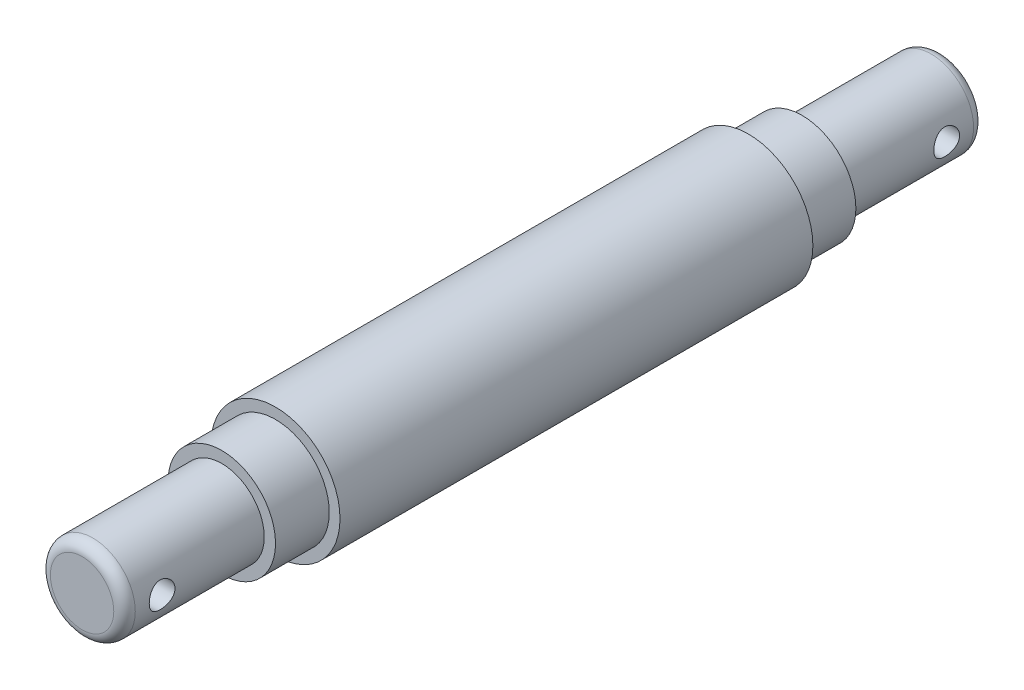
ISO-10303-21;
HEADER;
FILE_DESCRIPTION(('STEP AP214'),'2;1');
FILE_NAME('part.step','',(''),(''),'','','');
FILE_SCHEMA(('AUTOMOTIVE_DESIGN { 1 0 10303 214 1 1 1 1 }'));
ENDSEC;
DATA;
#1=APPLICATION_CONTEXT('core data for automotive mechanical design processes');
#2=APPLICATION_PROTOCOL_DEFINITION('international standard','automotive_design',2000,#1);
#3=PRODUCT_CONTEXT('',#1,'mechanical');
#4=PRODUCT('Part','Part','',(#3));
#5=PRODUCT_RELATED_PRODUCT_CATEGORY('part','',(#4));
#6=PRODUCT_DEFINITION_FORMATION('','',#4);
#7=PRODUCT_DEFINITION_CONTEXT('part definition',#1,'design');
#8=PRODUCT_DEFINITION('design','',#6,#7);
#9=PRODUCT_DEFINITION_SHAPE('','',#8);
#10=(LENGTH_UNIT() NAMED_UNIT(*) SI_UNIT(.MILLI.,.METRE.));
#11=(NAMED_UNIT(*) PLANE_ANGLE_UNIT() SI_UNIT($,.RADIAN.));
#12=(NAMED_UNIT(*) SI_UNIT($,.STERADIAN.) SOLID_ANGLE_UNIT());
#13=UNCERTAINTY_MEASURE_WITH_UNIT(LENGTH_MEASURE(1.E-05),#10,'distance_accuracy_value','');
#14=(GEOMETRIC_REPRESENTATION_CONTEXT(3) GLOBAL_UNCERTAINTY_ASSIGNED_CONTEXT((#13)) GLOBAL_UNIT_ASSIGNED_CONTEXT((#10,
#11,#12)) REPRESENTATION_CONTEXT('',''));
#15=CARTESIAN_POINT('',(0.,0.,0.));
#16=DIRECTION('',(0.,0.,1.));
#17=DIRECTION('',(1.,0.,0.));
#18=AXIS2_PLACEMENT_3D('',#15,#16,#17);
#19=CARTESIAN_POINT('',(0.,0.,13.));
#20=DIRECTION('',(0.,0.,-1.));
#21=DIRECTION('',(-1.,0.,0.));
#22=AXIS2_PLACEMENT_3D('',#19,#20,#21);
#23=CYLINDRICAL_SURFACE('',#22,3.95);
#24=CARTESIAN_POINT('',(-3.95,0.,4.7));
#25=CARTESIAN_POINT('',(-3.94999950148961,-0.0657921053393092,4.69999930906702));
#26=CARTESIAN_POINT('',(-3.94834057311497,-0.131591214838203,4.6945713423082));
#27=CARTESIAN_POINT('',(-3.94188498697175,-0.261270865350392,4.6730560327882));
#28=CARTESIAN_POINT('',(-3.93708746139314,-0.325150870627959,4.6569657419196));
#29=CARTESIAN_POINT('',(-3.92487988296748,-0.449103270402122,4.61471437021637));
#30=CARTESIAN_POINT('',(-3.91747374305666,-0.509181209664436,4.58856836763629));
#31=CARTESIAN_POINT('',(-3.90081718663398,-0.624100282433898,4.52701029085556));
#32=CARTESIAN_POINT('',(-3.89156651099519,-0.678940678549645,4.4915969145227));
#33=CARTESIAN_POINT('',(-3.87190239177238,-0.783438437222785,4.41141392945013));
#34=CARTESIAN_POINT('',(-3.86146466337097,-0.832920325244443,4.36642160808127));
#35=CARTESIAN_POINT('',(-3.84074643294284,-0.923765255505192,4.26883243051873));
#36=CARTESIAN_POINT('',(-3.83046595848297,-0.965126888957125,4.21623425752584));
#37=CARTESIAN_POINT('',(-3.81096820781044,-1.03948900030353,4.10343139989179));
#38=CARTESIAN_POINT('',(-3.80178104820255,-1.07227379069014,4.0430788331166));
#39=CARTESIAN_POINT('',(-3.78587377700205,-1.12715664878844,3.91739279236636));
#40=CARTESIAN_POINT('',(-3.77915305597243,-1.14925735687914,3.85206055365288));
#41=CARTESIAN_POINT('',(-3.76919296296908,-1.18150913793118,3.72024308420593));
#42=CARTESIAN_POINT('',(-3.76585939822971,-1.19198431895655,3.6538444632701));
#43=CARTESIAN_POINT('',(-3.76277100880303,-1.20169991107967,3.5201549851538));
#44=CARTESIAN_POINT('',(-3.76301529202458,-1.20094312272632,3.45286435456517));
#45=CARTESIAN_POINT('',(-3.76697161773738,-1.1884705081571,3.32195015706232));
#46=CARTESIAN_POINT('',(-3.7705546058486,-1.17716250700933,3.25828318605416));
#47=CARTESIAN_POINT('',(-3.78057558453502,-1.14456806673587,3.13379647114953));
#48=CARTESIAN_POINT('',(-3.7870138633498,-1.12328062017983,3.0729770153932));
#49=CARTESIAN_POINT('',(-3.80212175360936,-1.07103490290146,2.95492205528855));
#50=CARTESIAN_POINT('',(-3.81082129239325,-1.03994563160967,2.89774851954395));
#51=CARTESIAN_POINT('',(-3.82945730084039,-0.969069803090083,2.78929413758052));
#52=CARTESIAN_POINT('',(-3.8393940765405,-0.929281092164125,2.73801475536715));
#53=CARTESIAN_POINT('',(-3.85990662941459,-0.840117660833641,2.64049344535494));
#54=CARTESIAN_POINT('',(-3.87049153542939,-0.790405027053219,2.59456184826499));
#55=CARTESIAN_POINT('',(-3.8907306221033,-0.683850928056176,2.5116141422669));
#56=CARTESIAN_POINT('',(-3.90038474113935,-0.62700899141406,2.474598623408));
#57=CARTESIAN_POINT('',(-3.91776652995739,-0.507235607809572,2.4103388738867));
#58=CARTESIAN_POINT('',(-3.92548020503653,-0.44426422581595,2.38316503820175));
#59=CARTESIAN_POINT('',(-3.93801108754001,-0.314356032727517,2.33988627876673));
#60=CARTESIAN_POINT('',(-3.94282912421219,-0.247420362956477,2.32377818583952));
#61=CARTESIAN_POINT('',(-3.94889402423303,-0.114120636053968,2.30360840283639));
#62=CARTESIAN_POINT('',(-3.95026547137128,-0.0478257706931135,2.29912626814582));
#63=CARTESIAN_POINT('',(-3.94964905795108,0.0845739664892634,2.30115508783461));
#64=CARTESIAN_POINT('',(-3.94766165842204,0.150678863138068,2.30766453352876));
#65=CARTESIAN_POINT('',(-3.94063250926793,0.279224843718511,2.33115248464411));
#66=CARTESIAN_POINT('',(-3.93566287748284,0.341715383064578,2.34788396335906));
#67=CARTESIAN_POINT('',(-3.9232462867588,0.462987512144223,2.39104256352873));
#68=CARTESIAN_POINT('',(-3.91579902739437,0.521768651064517,2.41747086081413));
#69=CARTESIAN_POINT('',(-3.89897895098375,0.635489778460967,2.47996993053552));
#70=CARTESIAN_POINT('',(-3.88956496603778,0.690306912058738,2.51625286629778));
#71=CARTESIAN_POINT('',(-3.86989097410411,0.793217107200196,2.59717445146228));
#72=CARTESIAN_POINT('',(-3.85963075016098,0.841308435836414,2.64181524736854));
#73=CARTESIAN_POINT('',(-3.8389403158374,0.931262194728938,2.74016150577723));
#74=CARTESIAN_POINT('',(-3.82851804368209,0.972825315903955,2.79414300837538));
#75=CARTESIAN_POINT('',(-3.8090881755083,1.04632580306949,2.90854100899331));
#76=CARTESIAN_POINT('',(-3.80008054641565,1.07826339411975,2.96895735651179));
#77=CARTESIAN_POINT('',(-3.78460257028509,1.1313931380966,3.09433664984492));
#78=CARTESIAN_POINT('',(-3.77812098085675,1.15263302867236,3.15927789797527));
#79=CARTESIAN_POINT('',(-3.76847037643667,1.18380847718295,3.29204998471573));
#80=CARTESIAN_POINT('',(-3.76530018925136,1.19374803539959,3.35987979195805));
#81=CARTESIAN_POINT('',(-3.76274882724403,1.20176405179564,3.49338836687881));
#82=CARTESIAN_POINT('',(-3.76321151382289,1.20032934218194,3.55903517801601));
#83=CARTESIAN_POINT('',(-3.76749719259433,1.18680835860971,3.68910509986034));
#84=CARTESIAN_POINT('',(-3.77132004375065,1.17472253171075,3.7535282618118));
#85=CARTESIAN_POINT('',(-3.78178924861813,1.14056150948796,3.8785005993841));
#86=CARTESIAN_POINT('',(-3.7883980639779,1.11861887679372,3.93908938954065));
#87=CARTESIAN_POINT('',(-3.80368682812306,1.06547063438702,4.05577392163372));
#88=CARTESIAN_POINT('',(-3.81236718094976,1.03426321734227,4.1118687842014));
#89=CARTESIAN_POINT('',(-3.83122441855044,0.962110752635532,4.22023355022249));
#90=CARTESIAN_POINT('',(-3.84144499898209,0.920846329538669,4.27228319179532));
#91=CARTESIAN_POINT('',(-3.86202232713825,0.830322181374977,4.36887763125794));
#92=CARTESIAN_POINT('',(-3.872379109857,0.781060363153478,4.41342045815514));
#93=CARTESIAN_POINT('',(-3.89243751616363,0.674145848788933,4.49508126382335));
#94=CARTESIAN_POINT('',(-3.90210985106116,0.61628443568486,4.53193393655291));
#95=CARTESIAN_POINT('',(-3.91935319911683,0.494893212202997,4.59533761137733));
#96=CARTESIAN_POINT('',(-3.92692514826385,0.431365943417147,4.62189320423625));
#97=CARTESIAN_POINT('',(-3.93849330935894,0.307034616834357,4.66170303728427));
#98=CARTESIAN_POINT('',(-3.94277212268364,0.246597141950737,4.67602475329009));
#99=CARTESIAN_POINT('',(-3.94852545465588,0.124108329921255,4.69517271922448));
#100=CARTESIAN_POINT('',(-3.95000047021142,0.0620572807202984,4.70000065171074));
#101=CARTESIAN_POINT('',(-3.95,0.,4.7));
#102=B_SPLINE_CURVE_WITH_KNOTS('',3,(#24,#25,#26,#27,#28,#29,#30,#31,#32,#33,#34,#35,#36,#37,
#38,#39,#40,#41,#42,#43,#44,#45,#46,#47,#48,#49,#50,#51,#52,#53,#54,#55,#56,#57,#58,#59,#60,#61,
#62,#63,#64,#65,#66,#67,#68,#69,#70,#71,#72,#73,#74,#75,#76,#77,#78,#79,#80,#81,#82,#83,#84,#85,
#86,#87,#88,#89,#90,#91,#92,#93,#94,#95,#96,#97,#98,#99,#100,#101),.UNSPECIFIED.,.T.,.F.,(4,2,2,
2,2,2,2,2,2,2,2,2,2,2,2,2,2,2,2,2,2,2,2,2,2,2,2,2,2,2,2,2,2,2,2,2,2,2,4),(0.,0.197148320035392,
0.394351173873382,0.591259473294278,0.78819545460649,0.99034080236687,1.19252118949645,
1.39938126808359,1.60619019875128,1.80707614853398,2.00791201079834,2.20129315930618,
2.39469383394963,2.59079745889567,2.78694968780096,2.99151370492322,3.19609125598954,
3.40210447220442,3.6080586625695,3.80645362401527,4.00482135632748,4.19857515486445,
4.39235245564505,4.59068721838334,4.78907298841319,4.99485980438989,5.20064180838009,
5.40549720473313,5.61028006032374,5.80631124083041,6.00233419370823,6.19579632450157,
6.38929621983988,6.59000270555273,6.79076180702599,6.99759277849253,7.20433143185222,
7.39032118612837,7.57627797496914),.UNSPECIFIED.);
#103=CARTESIAN_POINT('',(-3.95,0.,4.7));
#104=VERTEX_POINT('',#103);
#105=EDGE_CURVE('E35',#104,#104,#102,.T.);
#106=ORIENTED_EDGE('',*,*,#105,.T.);
#107=EDGE_LOOP('',(#106));
#108=FACE_BOUND('',#107,.T.);
#109=CARTESIAN_POINT('',(3.95,0.,2.3));
#110=CARTESIAN_POINT('',(3.94999950148961,-0.0657921053393094,2.30000069093297));
#111=CARTESIAN_POINT('',(3.94834057311497,-0.131591214838203,2.3054286576918));
#112=CARTESIAN_POINT('',(3.94188498697175,-0.261270865350393,2.32694396721179));
#113=CARTESIAN_POINT('',(3.93708746139314,-0.325150870627959,2.34303425808039));
#114=CARTESIAN_POINT('',(3.92487988296748,-0.449103270402122,2.38528562978362));
#115=CARTESIAN_POINT('',(3.91747374305666,-0.509181209664436,2.4114316323637));
#116=CARTESIAN_POINT('',(3.90081718663398,-0.624100282433898,2.47298970914444));
#117=CARTESIAN_POINT('',(3.89156651099519,-0.678940678549646,2.5084030854773));
#118=CARTESIAN_POINT('',(3.87190239177238,-0.783438437222785,2.58858607054987));
#119=CARTESIAN_POINT('',(3.86146466337097,-0.832920325244444,2.63357839191873));
#120=CARTESIAN_POINT('',(3.84074643294284,-0.923765255505193,2.73116756948126));
#121=CARTESIAN_POINT('',(3.83046595848297,-0.965126888957126,2.78376574247416));
#122=CARTESIAN_POINT('',(3.81096820781044,-1.03948900030353,2.89656860010821));
#123=CARTESIAN_POINT('',(3.80178104820255,-1.07227379069014,2.9569211668834));
#124=CARTESIAN_POINT('',(3.78587377700205,-1.12715664878844,3.08260720763363));
#125=CARTESIAN_POINT('',(3.77915305597243,-1.14925735687915,3.14793944634711));
#126=CARTESIAN_POINT('',(3.76919296296908,-1.18150913793118,3.27975691579407));
#127=CARTESIAN_POINT('',(3.76585939822971,-1.19198431895655,3.3461555367299));
#128=CARTESIAN_POINT('',(3.76277100880303,-1.20169991107967,3.4798450148462));
#129=CARTESIAN_POINT('',(3.76301529202458,-1.20094312272632,3.54713564543482));
#130=CARTESIAN_POINT('',(3.76697161773738,-1.1884705081571,3.67804984293767));
#131=CARTESIAN_POINT('',(3.7705546058486,-1.17716250700933,3.74171681394584));
#132=CARTESIAN_POINT('',(3.78057558453502,-1.14456806673587,3.86620352885046));
#133=CARTESIAN_POINT('',(3.7870138633498,-1.12328062017983,3.92702298460679));
#134=CARTESIAN_POINT('',(3.80212175360936,-1.07103490290146,4.04507794471145));
#135=CARTESIAN_POINT('',(3.81082129239325,-1.03994563160967,4.10225148045604));
#136=CARTESIAN_POINT('',(3.82945730084039,-0.969069803090083,4.21070586241947));
#137=CARTESIAN_POINT('',(3.8393940765405,-0.929281092164126,4.26198524463285));
#138=CARTESIAN_POINT('',(3.85990662941459,-0.840117660833642,4.35950655464505));
#139=CARTESIAN_POINT('',(3.87049153542939,-0.79040502705322,4.405438151735));
#140=CARTESIAN_POINT('',(3.8907306221033,-0.683850928056177,4.4883858577331));
#141=CARTESIAN_POINT('',(3.90038474113935,-0.627008991414061,4.52540137659199));
#142=CARTESIAN_POINT('',(3.91776652995739,-0.507235607809573,4.58966112611329));
#143=CARTESIAN_POINT('',(3.92548020503653,-0.444264225815951,4.61683496179825));
#144=CARTESIAN_POINT('',(3.93801108754001,-0.314356032727518,4.66011372123327));
#145=CARTESIAN_POINT('',(3.94282912421219,-0.247420362956478,4.67622181416047));
#146=CARTESIAN_POINT('',(3.94889402423303,-0.114120636053968,4.69639159716361));
#147=CARTESIAN_POINT('',(3.95026547137128,-0.0478257706931138,4.70087373185417));
#148=CARTESIAN_POINT('',(3.94964905795108,0.0845739664892633,4.69884491216539));
#149=CARTESIAN_POINT('',(3.94766165842204,0.150678863138068,4.69233546647123));
#150=CARTESIAN_POINT('',(3.94063250926793,0.27922484371851,4.66884751535588));
#151=CARTESIAN_POINT('',(3.93566287748284,0.341715383064577,4.65211603664094));
#152=CARTESIAN_POINT('',(3.9232462867588,0.462987512144222,4.60895743647126));
#153=CARTESIAN_POINT('',(3.91579902739437,0.521768651064517,4.58252913918586));
#154=CARTESIAN_POINT('',(3.89897895098375,0.635489778460967,4.52003006946447));
#155=CARTESIAN_POINT('',(3.88956496603778,0.690306912058738,4.48374713370222));
#156=CARTESIAN_POINT('',(3.86989097410411,0.793217107200197,4.40282554853771));
#157=CARTESIAN_POINT('',(3.85963075016098,0.841308435836415,4.35818475263145));
#158=CARTESIAN_POINT('',(3.8389403158374,0.931262194728939,4.25983849422276));
#159=CARTESIAN_POINT('',(3.82851804368209,0.972825315903956,4.20585699162462));
#160=CARTESIAN_POINT('',(3.8090881755083,1.04632580306949,4.09145899100669));
#161=CARTESIAN_POINT('',(3.80008054641565,1.07826339411975,4.03104264348821));
#162=CARTESIAN_POINT('',(3.78460257028509,1.1313931380966,3.90566335015508));
#163=CARTESIAN_POINT('',(3.77812098085675,1.15263302867236,3.84072210202473));
#164=CARTESIAN_POINT('',(3.76847037643667,1.18380847718295,3.70795001528427));
#165=CARTESIAN_POINT('',(3.76530018925136,1.19374803539959,3.64012020804194));
#166=CARTESIAN_POINT('',(3.76274882724403,1.20176405179564,3.50661163312118));
#167=CARTESIAN_POINT('',(3.76321151382289,1.20032934218194,3.44096482198399));
#168=CARTESIAN_POINT('',(3.76749719259433,1.18680835860971,3.31089490013965));
#169=CARTESIAN_POINT('',(3.77132004375065,1.17472253171075,3.24647173818819));
#170=CARTESIAN_POINT('',(3.78178924861813,1.14056150948796,3.12149940061589));
#171=CARTESIAN_POINT('',(3.7883980639779,1.11861887679372,3.06091061045934));
#172=CARTESIAN_POINT('',(3.80368682812306,1.06547063438702,2.94422607836627));
#173=CARTESIAN_POINT('',(3.81236718094976,1.03426321734227,2.88813121579859));
#174=CARTESIAN_POINT('',(3.83122441855044,0.962110752635532,2.7797664497775));
#175=CARTESIAN_POINT('',(3.84144499898209,0.920846329538669,2.72771680820468));
#176=CARTESIAN_POINT('',(3.86202232713825,0.830322181374976,2.63112236874205));
#177=CARTESIAN_POINT('',(3.872379109857,0.781060363153478,2.58657954184485));
#178=CARTESIAN_POINT('',(3.89243751616364,0.674145848788934,2.50491873617665));
#179=CARTESIAN_POINT('',(3.90210985106116,0.616284435684861,2.46806606344709));
#180=CARTESIAN_POINT('',(3.91935319911683,0.494893212202997,2.40466238862266));
#181=CARTESIAN_POINT('',(3.92692514826385,0.431365943417147,2.37810679576375));
#182=CARTESIAN_POINT('',(3.93849330935894,0.307034616834357,2.33829696271572));
#183=CARTESIAN_POINT('',(3.94277212268364,0.246597141950738,2.3239752467099));
#184=CARTESIAN_POINT('',(3.94852545465588,0.124108329921256,2.30482728077552));
#185=CARTESIAN_POINT('',(3.95000047021142,0.0620572807202987,2.29999934828926));
#186=CARTESIAN_POINT('',(3.95,0.,2.3));
#187=B_SPLINE_CURVE_WITH_KNOTS('',3,(#109,#110,#111,#112,#113,#114,#115,#116,#117,#118,#119,
#120,#121,#122,#123,#124,#125,#126,#127,#128,#129,#130,#131,#132,#133,#134,#135,#136,#137,#138,
#139,#140,#141,#142,#143,#144,#145,#146,#147,#148,#149,#150,#151,#152,#153,#154,#155,#156,#157,
#158,#159,#160,#161,#162,#163,#164,#165,#166,#167,#168,#169,#170,#171,#172,#173,#174,#175,#176,
#177,#178,#179,#180,#181,#182,#183,#184,#185,#186),.UNSPECIFIED.,.T.,.F.,(4,2,2,2,2,2,2,2,2,2,2,
2,2,2,2,2,2,2,2,2,2,2,2,2,2,2,2,2,2,2,2,2,2,2,2,2,2,2,4),(0.,0.197148320035392,
0.394351173873383,0.591259473294278,0.788195454606491,0.990340802366871,1.19252118949645,
1.39938126808359,1.60619019875128,1.80707614853398,2.00791201079834,2.20129315930618,
2.39469383394963,2.59079745889567,2.78694968780096,2.99151370492322,3.19609125598954,
3.40210447220442,3.6080586625695,3.80645362401527,4.00482135632748,4.19857515486445,
4.39235245564505,4.59068721838334,4.78907298841319,4.99485980438989,5.2006418083801,
5.40549720473313,5.61028006032374,5.80631124083041,6.00233419370823,6.19579632450157,
6.38929621983989,6.59000270555273,6.79076180702599,6.99759277849253,7.20433143185222,
7.39032118612838,7.57627797496914),.UNSPECIFIED.);
#188=CARTESIAN_POINT('',(3.95,0.,2.3));
#189=VERTEX_POINT('',#188);
#190=EDGE_CURVE('E98',#189,#189,#187,.T.);
#191=ORIENTED_EDGE('',*,*,#190,.T.);
#192=EDGE_LOOP('',(#191));
#193=FACE_BOUND('',#192,.T.);
#194=CARTESIAN_POINT('',(0.,0.,0.999999999999997));
#195=DIRECTION('',(0.,0.,1.));
#196=DIRECTION('',(1.,0.,0.));
#197=AXIS2_PLACEMENT_3D('',#194,#195,#196);
#198=CIRCLE('',#197,3.95);
#199=CARTESIAN_POINT('',(3.95,0.,0.999999999999997));
#200=VERTEX_POINT('',#199);
#201=EDGE_CURVE('E43',#200,#200,#198,.T.);
#202=ORIENTED_EDGE('',*,*,#201,.T.);
#203=EDGE_LOOP('',(#202));
#204=FACE_BOUND('',#203,.T.);
#205=CARTESIAN_POINT('',(0.,0.,13.));
#206=DIRECTION('',(0.,0.,1.));
#207=DIRECTION('',(1.,0.,0.));
#208=AXIS2_PLACEMENT_3D('',#205,#206,#207);
#209=CIRCLE('',#208,3.95);
#210=CARTESIAN_POINT('',(3.95,0.,13.));
#211=VERTEX_POINT('',#210);
#212=EDGE_CURVE('E216',#211,#211,#209,.T.);
#213=ORIENTED_EDGE('',*,*,#212,.F.);
#214=EDGE_LOOP('',(#213));
#215=FACE_BOUND('',#214,.T.);
#216=ADVANCED_FACE('F31',(#108,#193,#204,#215),#23,.T.);
#217=CARTESIAN_POINT('',(0.,0.,0.));
#218=DIRECTION('',(0.,0.,1.));
#219=DIRECTION('',(1.,0.,0.));
#220=AXIS2_PLACEMENT_3D('',#217,#218,#219);
#221=PLANE('',#220);
#222=CARTESIAN_POINT('',(0.,0.,0.));
#223=DIRECTION('',(0.,0.,1.));
#224=DIRECTION('',(1.,0.,0.));
#225=AXIS2_PLACEMENT_3D('',#222,#223,#224);
#226=CIRCLE('',#225,2.95);
#227=CARTESIAN_POINT('',(2.95,0.,0.));
#228=VERTEX_POINT('',#227);
#229=EDGE_CURVE('E10',#228,#228,#226,.F.);
#230=ORIENTED_EDGE('',*,*,#229,.T.);
#231=EDGE_LOOP('',(#230));
#232=FACE_BOUND('',#231,.T.);
#233=ADVANCED_FACE('F86',(#232),#221,.F.);
#234=CARTESIAN_POINT('',(0.,0.,18.));
#235=DIRECTION('',(0.,0.,-1.));
#236=DIRECTION('',(-1.,0.,0.));
#237=AXIS2_PLACEMENT_3D('',#234,#235,#236);
#238=CYLINDRICAL_SURFACE('',#237,5.);
#239=CARTESIAN_POINT('',(0.,0.,18.));
#240=DIRECTION('',(0.,0.,1.));
#241=DIRECTION('',(1.,0.,0.));
#242=AXIS2_PLACEMENT_3D('',#239,#240,#241);
#243=CIRCLE('',#242,5.);
#244=CARTESIAN_POINT('',(5.,0.,18.));
#245=VERTEX_POINT('',#244);
#246=EDGE_CURVE('E209',#245,#245,#243,.T.);
#247=ORIENTED_EDGE('',*,*,#246,.F.);
#248=EDGE_LOOP('',(#247));
#249=FACE_BOUND('',#248,.T.);
#250=CARTESIAN_POINT('',(0.,0.,13.));
#251=DIRECTION('',(0.,0.,1.));
#252=DIRECTION('',(1.,0.,0.));
#253=AXIS2_PLACEMENT_3D('',#250,#251,#252);
#254=CIRCLE('',#253,5.);
#255=CARTESIAN_POINT('',(5.,0.,13.));
#256=VERTEX_POINT('',#255);
#257=EDGE_CURVE('E212',#256,#256,#254,.T.);
#258=ORIENTED_EDGE('',*,*,#257,.T.);
#259=EDGE_LOOP('',(#258));
#260=FACE_BOUND('',#259,.T.);
#261=ADVANCED_FACE('F91',(#249,#260),#238,.T.);
#262=CARTESIAN_POINT('',(0.,0.,13.));
#263=DIRECTION('',(0.,0.,1.));
#264=DIRECTION('',(1.,0.,0.));
#265=AXIS2_PLACEMENT_3D('',#262,#263,#264);
#266=PLANE('',#265);
#267=ORIENTED_EDGE('',*,*,#212,.T.);
#268=EDGE_LOOP('',(#267));
#269=FACE_BOUND('',#268,.T.);
#270=ORIENTED_EDGE('',*,*,#257,.F.);
#271=EDGE_LOOP('',(#270));
#272=FACE_BOUND('',#271,.T.);
#273=ADVANCED_FACE('F186',(#269,#272),#266,.F.);
#274=CARTESIAN_POINT('',(0.,0.,62.));
#275=DIRECTION('',(0.,0.,-1.));
#276=DIRECTION('',(-1.,0.,0.));
#277=AXIS2_PLACEMENT_3D('',#274,#275,#276);
#278=CYLINDRICAL_SURFACE('',#277,6.);
#279=CARTESIAN_POINT('',(0.,0.,62.));
#280=DIRECTION('',(0.,0.,1.));
#281=DIRECTION('',(1.,0.,0.));
#282=AXIS2_PLACEMENT_3D('',#279,#280,#281);
#283=CIRCLE('',#282,6.);
#284=CARTESIAN_POINT('',(6.,0.,62.));
#285=VERTEX_POINT('',#284);
#286=EDGE_CURVE('E214',#285,#285,#283,.T.);
#287=ORIENTED_EDGE('',*,*,#286,.F.);
#288=EDGE_LOOP('',(#287));
#289=FACE_BOUND('',#288,.T.);
#290=CARTESIAN_POINT('',(0.,0.,18.));
#291=DIRECTION('',(0.,0.,1.));
#292=DIRECTION('',(1.,0.,0.));
#293=AXIS2_PLACEMENT_3D('',#290,#291,#292);
#294=CIRCLE('',#293,6.);
#295=CARTESIAN_POINT('',(6.,0.,18.));
#296=VERTEX_POINT('',#295);
#297=EDGE_CURVE('E219',#296,#296,#294,.T.);
#298=ORIENTED_EDGE('',*,*,#297,.T.);
#299=EDGE_LOOP('',(#298));
#300=FACE_BOUND('',#299,.T.);
#301=ADVANCED_FACE('F169',(#289,#300),#278,.T.);
#302=CARTESIAN_POINT('',(0.,0.,62.));
#303=DIRECTION('',(0.,0.,1.));
#304=DIRECTION('',(1.,0.,0.));
#305=AXIS2_PLACEMENT_3D('',#302,#303,#304);
#306=PLANE('',#305);
#307=CARTESIAN_POINT('',(0.,0.,62.));
#308=DIRECTION('',(0.,0.,1.));
#309=DIRECTION('',(1.,0.,0.));
#310=AXIS2_PLACEMENT_3D('',#307,#308,#309);
#311=CIRCLE('',#310,5.);
#312=CARTESIAN_POINT('',(5.,0.,62.));
#313=VERTEX_POINT('',#312);
#314=EDGE_CURVE('E235',#313,#313,#311,.T.);
#315=ORIENTED_EDGE('',*,*,#314,.F.);
#316=EDGE_LOOP('',(#315));
#317=FACE_BOUND('',#316,.T.);
#318=ORIENTED_EDGE('',*,*,#286,.T.);
#319=EDGE_LOOP('',(#318));
#320=FACE_BOUND('',#319,.T.);
#321=ADVANCED_FACE('F164',(#317,#320),#306,.T.);
#322=CARTESIAN_POINT('',(0.,0.,18.));
#323=DIRECTION('',(0.,0.,1.));
#324=DIRECTION('',(1.,0.,0.));
#325=AXIS2_PLACEMENT_3D('',#322,#323,#324);
#326=PLANE('',#325);
#327=ORIENTED_EDGE('',*,*,#246,.T.);
#328=EDGE_LOOP('',(#327));
#329=FACE_BOUND('',#328,.T.);
#330=ORIENTED_EDGE('',*,*,#297,.F.);
#331=EDGE_LOOP('',(#330));
#332=FACE_BOUND('',#331,.T.);
#333=ADVANCED_FACE('F156',(#329,#332),#326,.F.);
#334=CARTESIAN_POINT('',(0.,0.,67.));
#335=DIRECTION('',(0.,0.,-1.));
#336=DIRECTION('',(-1.,0.,0.));
#337=AXIS2_PLACEMENT_3D('',#334,#335,#336);
#338=CYLINDRICAL_SURFACE('',#337,5.);
#339=CARTESIAN_POINT('',(0.,0.,67.));
#340=DIRECTION('',(0.,0.,1.));
#341=DIRECTION('',(1.,0.,0.));
#342=AXIS2_PLACEMENT_3D('',#339,#340,#341);
#343=CIRCLE('',#342,5.);
#344=CARTESIAN_POINT('',(5.,0.,67.));
#345=VERTEX_POINT('',#344);
#346=EDGE_CURVE('E238',#345,#345,#343,.T.);
#347=ORIENTED_EDGE('',*,*,#346,.F.);
#348=EDGE_LOOP('',(#347));
#349=FACE_BOUND('',#348,.T.);
#350=ORIENTED_EDGE('',*,*,#314,.T.);
#351=EDGE_LOOP('',(#350));
#352=FACE_BOUND('',#351,.T.);
#353=ADVANCED_FACE('F147',(#349,#352),#338,.T.);
#354=CARTESIAN_POINT('',(0.,0.,67.));
#355=DIRECTION('',(0.,0.,1.));
#356=DIRECTION('',(1.,0.,0.));
#357=AXIS2_PLACEMENT_3D('',#354,#355,#356);
#358=PLANE('',#357);
#359=CARTESIAN_POINT('',(0.,0.,67.));
#360=DIRECTION('',(0.,0.,1.));
#361=DIRECTION('',(1.,0.,0.));
#362=AXIS2_PLACEMENT_3D('',#359,#360,#361);
#363=CIRCLE('',#362,3.95);
#364=CARTESIAN_POINT('',(3.95,0.,67.));
#365=VERTEX_POINT('',#364);
#366=EDGE_CURVE('E234',#365,#365,#363,.T.);
#367=ORIENTED_EDGE('',*,*,#366,.F.);
#368=EDGE_LOOP('',(#367));
#369=FACE_BOUND('',#368,.T.);
#370=ORIENTED_EDGE('',*,*,#346,.T.);
#371=EDGE_LOOP('',(#370));
#372=FACE_BOUND('',#371,.T.);
#373=ADVANCED_FACE('F82',(#369,#372),#358,.T.);
#374=CARTESIAN_POINT('',(0.,0.,80.));
#375=DIRECTION('',(0.,0.,-1.));
#376=DIRECTION('',(-1.,0.,0.));
#377=AXIS2_PLACEMENT_3D('',#374,#375,#376);
#378=CYLINDRICAL_SURFACE('',#377,3.95);
#379=CARTESIAN_POINT('',(-3.95,0.,77.7));
#380=CARTESIAN_POINT('',(-3.94999950148961,-0.0657921053393096,77.699999309067));
#381=CARTESIAN_POINT('',(-3.94834057311497,-0.131591214838203,77.6945713423082));
#382=CARTESIAN_POINT('',(-3.94188498697175,-0.261270865350392,77.6730560327882));
#383=CARTESIAN_POINT('',(-3.93708746139313,-0.325150870627959,77.6569657419196));
#384=CARTESIAN_POINT('',(-3.92487988296748,-0.449103270402122,77.6147143702164));
#385=CARTESIAN_POINT('',(-3.91747374305666,-0.509181209664437,77.5885683676363));
#386=CARTESIAN_POINT('',(-3.90081718663398,-0.624100282433899,77.5270102908556));
#387=CARTESIAN_POINT('',(-3.89156651099519,-0.678940678549646,77.4915969145227));
#388=CARTESIAN_POINT('',(-3.87190239177238,-0.783438437222781,77.4114139294501));
#389=CARTESIAN_POINT('',(-3.86146466337097,-0.832920325244437,77.3664216080813));
#390=CARTESIAN_POINT('',(-3.84074643294284,-0.923765255505187,77.2688324305187));
#391=CARTESIAN_POINT('',(-3.83046595848297,-0.965126888957124,77.2162342575258));
#392=CARTESIAN_POINT('',(-3.81096820781043,-1.03948900030353,77.1034313998918));
#393=CARTESIAN_POINT('',(-3.80178104820255,-1.07227379069014,77.0430788331166));
#394=CARTESIAN_POINT('',(-3.78587377700204,-1.12715664878845,76.9173927923664));
#395=CARTESIAN_POINT('',(-3.77915305597243,-1.14925735687915,76.8520605536529));
#396=CARTESIAN_POINT('',(-3.76919296296908,-1.18150913793118,76.7202430842059));
#397=CARTESIAN_POINT('',(-3.76585939822971,-1.19198431895655,76.6538444632701));
#398=CARTESIAN_POINT('',(-3.76277100880303,-1.20169991107967,76.5201549851538));
#399=CARTESIAN_POINT('',(-3.76301529202458,-1.20094312272632,76.4528643545652));
#400=CARTESIAN_POINT('',(-3.76697161773738,-1.1884705081571,76.3219501570623));
#401=CARTESIAN_POINT('',(-3.7705546058486,-1.17716250700933,76.2582831860542));
#402=CARTESIAN_POINT('',(-3.78057558453502,-1.14456806673587,76.1337964711495));
#403=CARTESIAN_POINT('',(-3.7870138633498,-1.12328062017983,76.0729770153932));
#404=CARTESIAN_POINT('',(-3.80212175360936,-1.07103490290146,75.9549220552885));
#405=CARTESIAN_POINT('',(-3.81082129239325,-1.03994563160967,75.8977485195439));
#406=CARTESIAN_POINT('',(-3.82945730084039,-0.969069803090081,75.7892941375805));
#407=CARTESIAN_POINT('',(-3.8393940765405,-0.929281092164127,75.7380147553671));
#408=CARTESIAN_POINT('',(-3.85990662941459,-0.840117660833646,75.6404934453549));
#409=CARTESIAN_POINT('',(-3.87049153542939,-0.790405027053225,75.594561848265));
#410=CARTESIAN_POINT('',(-3.8907306221033,-0.683850928056181,75.5116141422669));
#411=CARTESIAN_POINT('',(-3.90038474113935,-0.627008991414064,75.474598623408));
#412=CARTESIAN_POINT('',(-3.91776652995739,-0.507235607809574,75.4103388738867));
#413=CARTESIAN_POINT('',(-3.92548020503653,-0.444264225815952,75.3831650382018));
#414=CARTESIAN_POINT('',(-3.93801108754001,-0.314356032727516,75.3398862787667));
#415=CARTESIAN_POINT('',(-3.94282912421219,-0.247420362956473,75.3237781858395));
#416=CARTESIAN_POINT('',(-3.94889402423303,-0.114120636053963,75.3036084028364));
#417=CARTESIAN_POINT('',(-3.95026547137128,-0.0478257706931101,75.2991262681458));
#418=CARTESIAN_POINT('',(-3.94964905795108,0.0845739664892649,75.3011550878346));
#419=CARTESIAN_POINT('',(-3.94766165842204,0.150678863138069,75.3076645335288));
#420=CARTESIAN_POINT('',(-3.94063250926793,0.279224843718509,75.3311524846441));
#421=CARTESIAN_POINT('',(-3.93566287748284,0.341715383064575,75.3478839633591));
#422=CARTESIAN_POINT('',(-3.9232462867588,0.46298751214422,75.3910425635287));
#423=CARTESIAN_POINT('',(-3.91579902739437,0.521768651064516,75.4174708608141));
#424=CARTESIAN_POINT('',(-3.89897895098375,0.635489778460967,75.4799699305355));
#425=CARTESIAN_POINT('',(-3.88956496603778,0.690306912058738,75.5162528662978));
#426=CARTESIAN_POINT('',(-3.86989097410411,0.793217107200196,75.5971744514623));
#427=CARTESIAN_POINT('',(-3.85963075016098,0.841308435836415,75.6418152473685));
#428=CARTESIAN_POINT('',(-3.8389403158374,0.931262194728941,75.7401615057772));
#429=CARTESIAN_POINT('',(-3.82851804368209,0.972825315903959,75.7941430083754));
#430=CARTESIAN_POINT('',(-3.8090881755083,1.04632580306949,75.9085410089933));
#431=CARTESIAN_POINT('',(-3.80008054641565,1.07826339411975,75.9689573565118));
#432=CARTESIAN_POINT('',(-3.78460257028509,1.13139313809661,76.0943366498449));
#433=CARTESIAN_POINT('',(-3.77812098085675,1.15263302867236,76.1592778979753));
#434=CARTESIAN_POINT('',(-3.76847037643667,1.18380847718295,76.2920499847157));
#435=CARTESIAN_POINT('',(-3.76530018925136,1.1937480353996,76.3598797919581));
#436=CARTESIAN_POINT('',(-3.76274882724403,1.20176405179564,76.4933883668788));
#437=CARTESIAN_POINT('',(-3.76321151382289,1.20032934218194,76.559035178016));
#438=CARTESIAN_POINT('',(-3.76749719259433,1.18680835860971,76.6891050998604));
#439=CARTESIAN_POINT('',(-3.77132004375065,1.17472253171075,76.7535282618118));
#440=CARTESIAN_POINT('',(-3.78178924861813,1.14056150948796,76.8785005993841));
#441=CARTESIAN_POINT('',(-3.7883980639779,1.11861887679372,76.9390893895407));
#442=CARTESIAN_POINT('',(-3.80368682812306,1.06547063438702,77.0557739216337));
#443=CARTESIAN_POINT('',(-3.81236718094976,1.03426321734227,77.1118687842014));
#444=CARTESIAN_POINT('',(-3.83122441855044,0.962110752635531,77.2202335502225));
#445=CARTESIAN_POINT('',(-3.84144499898209,0.920846329538671,77.2722831917953));
#446=CARTESIAN_POINT('',(-3.86202232713825,0.83032218137498,77.3688776312579));
#447=CARTESIAN_POINT('',(-3.872379109857,0.78106036315348,77.4134204581551));
#448=CARTESIAN_POINT('',(-3.89243751616363,0.674145848788935,77.4950812638234));
#449=CARTESIAN_POINT('',(-3.90210985106116,0.616284435684863,77.5319339365529));
#450=CARTESIAN_POINT('',(-3.91935319911683,0.494893212203,77.5953376113773));
#451=CARTESIAN_POINT('',(-3.92692514826385,0.431365943417149,77.6218932042362));
#452=CARTESIAN_POINT('',(-3.93849330935894,0.307034616834357,77.6617030372843));
#453=CARTESIAN_POINT('',(-3.94277212268364,0.246597141950737,77.6760247532901));
#454=CARTESIAN_POINT('',(-3.94852545465588,0.124108329921254,77.6951727192245));
#455=CARTESIAN_POINT('',(-3.95000047021142,0.0620572807202979,77.7000006517108));
#456=CARTESIAN_POINT('',(-3.95,0.,77.7));
#457=B_SPLINE_CURVE_WITH_KNOTS('',3,(#379,#380,#381,#382,#383,#384,#385,#386,#387,#388,#389,
#390,#391,#392,#393,#394,#395,#396,#397,#398,#399,#400,#401,#402,#403,#404,#405,#406,#407,#408,
#409,#410,#411,#412,#413,#414,#415,#416,#417,#418,#419,#420,#421,#422,#423,#424,#425,#426,#427,
#428,#429,#430,#431,#432,#433,#434,#435,#436,#437,#438,#439,#440,#441,#442,#443,#444,#445,#446,
#447,#448,#449,#450,#451,#452,#453,#454,#455,#456),.UNSPECIFIED.,.T.,.F.,(4,2,2,2,2,2,2,2,2,2,2,
2,2,2,2,2,2,2,2,2,2,2,2,2,2,2,2,2,2,2,2,2,2,2,2,2,2,2,4),(0.,0.197148320035393,
0.394351173873383,0.591259473294278,0.788195454606485,0.990340802366863,1.19252118949644,
1.3993812680836,1.60619019875129,1.80707614853398,2.00791201079834,2.20129315930618,
2.39469383394965,2.59079745889568,2.78694968780097,2.99151370492322,3.19609125598954,
3.40210447220442,3.6080586625695,3.80645362401528,4.00482135632748,4.19857515486445,
4.39235245564506,4.59068721838334,4.78907298841319,4.9948598043899,5.20064180838011,
5.40549720473314,5.61028006032373,5.80631124083043,6.00233419370825,6.19579632450158,
6.3892962198399,6.59000270555274,6.790761807026,6.99759277849253,7.20433143185223,
7.39032118612838,7.57627797496915),.UNSPECIFIED.);
#458=CARTESIAN_POINT('',(-3.95,0.,77.7));
#459=VERTEX_POINT('',#458);
#460=EDGE_CURVE('E59',#459,#459,#457,.T.);
#461=ORIENTED_EDGE('',*,*,#460,.T.);
#462=EDGE_LOOP('',(#461));
#463=FACE_BOUND('',#462,.T.);
#464=CARTESIAN_POINT('',(3.95,0.,75.3));
#465=CARTESIAN_POINT('',(3.94999950148961,-0.0657921053393096,75.300000690933));
#466=CARTESIAN_POINT('',(3.94834057311497,-0.131591214838203,75.3054286576918));
#467=CARTESIAN_POINT('',(3.94188498697175,-0.261270865350393,75.3269439672118));
#468=CARTESIAN_POINT('',(3.93708746139313,-0.325150870627959,75.3430342580804));
#469=CARTESIAN_POINT('',(3.92487988296748,-0.44910327040212,75.3852856297836));
#470=CARTESIAN_POINT('',(3.91747374305666,-0.509181209664433,75.4114316323637));
#471=CARTESIAN_POINT('',(3.90081718663398,-0.624100282433895,75.4729897091444));
#472=CARTESIAN_POINT('',(3.89156651099519,-0.678940678549644,75.5084030854773));
#473=CARTESIAN_POINT('',(3.87190239177238,-0.783438437222782,75.5885860705499));
#474=CARTESIAN_POINT('',(3.86146466337097,-0.832920325244437,75.6335783919187));
#475=CARTESIAN_POINT('',(3.84074643294284,-0.923765255505187,75.7311675694813));
#476=CARTESIAN_POINT('',(3.83046595848297,-0.965126888957124,75.7837657424742));
#477=CARTESIAN_POINT('',(3.81096820781043,-1.03948900030353,75.8965686001082));
#478=CARTESIAN_POINT('',(3.80178104820255,-1.07227379069014,75.9569211668834));
#479=CARTESIAN_POINT('',(3.78587377700204,-1.12715664878844,76.0826072076336));
#480=CARTESIAN_POINT('',(3.77915305597243,-1.14925735687915,76.1479394463471));
#481=CARTESIAN_POINT('',(3.76919296296908,-1.18150913793118,76.2797569157941));
#482=CARTESIAN_POINT('',(3.76585939822971,-1.19198431895656,76.3461555367299));
#483=CARTESIAN_POINT('',(3.76277100880303,-1.20169991107967,76.4798450148462));
#484=CARTESIAN_POINT('',(3.76301529202458,-1.20094312272632,76.5471356454348));
#485=CARTESIAN_POINT('',(3.76697161773738,-1.1884705081571,76.6780498429377));
#486=CARTESIAN_POINT('',(3.7705546058486,-1.17716250700933,76.7417168139458));
#487=CARTESIAN_POINT('',(3.78057558453502,-1.14456806673587,76.8662035288505));
#488=CARTESIAN_POINT('',(3.7870138633498,-1.12328062017983,76.9270229846068));
#489=CARTESIAN_POINT('',(3.80212175360936,-1.07103490290147,77.0450779447115));
#490=CARTESIAN_POINT('',(3.81082129239325,-1.03994563160967,77.102251480456));
#491=CARTESIAN_POINT('',(3.82945730084038,-0.969069803090082,77.2107058624195));
#492=CARTESIAN_POINT('',(3.8393940765405,-0.929281092164127,77.2619852446329));
#493=CARTESIAN_POINT('',(3.85990662941459,-0.840117660833646,77.3595065546451));
#494=CARTESIAN_POINT('',(3.87049153542939,-0.790405027053225,77.405438151735));
#495=CARTESIAN_POINT('',(3.8907306221033,-0.683850928056181,77.4883858577331));
#496=CARTESIAN_POINT('',(3.90038474113935,-0.627008991414064,77.525401376592));
#497=CARTESIAN_POINT('',(3.91776652995739,-0.507235607809574,77.5896611261133));
#498=CARTESIAN_POINT('',(3.92548020503653,-0.444264225815952,77.6168349617982));
#499=CARTESIAN_POINT('',(3.93801108754001,-0.314356032727516,77.6601137212333));
#500=CARTESIAN_POINT('',(3.94282912421219,-0.247420362956473,77.6762218141605));
#501=CARTESIAN_POINT('',(3.94889402423303,-0.114120636053963,77.6963915971636));
#502=CARTESIAN_POINT('',(3.95026547137128,-0.0478257706931102,77.7008737318542));
#503=CARTESIAN_POINT('',(3.94964905795108,0.0845739664892648,77.6988449121654));
#504=CARTESIAN_POINT('',(3.94766165842204,0.150678863138069,77.6923354664712));
#505=CARTESIAN_POINT('',(3.94063250926793,0.279224843718509,77.6688475153559));
#506=CARTESIAN_POINT('',(3.93566287748284,0.341715383064575,77.6521160366409));
#507=CARTESIAN_POINT('',(3.9232462867588,0.46298751214422,77.6089574364713));
#508=CARTESIAN_POINT('',(3.91579902739437,0.521768651064516,77.5825291391859));
#509=CARTESIAN_POINT('',(3.89897895098375,0.635489778460967,77.5200300694645));
#510=CARTESIAN_POINT('',(3.88956496603778,0.690306912058738,77.4837471337022));
#511=CARTESIAN_POINT('',(3.86989097410411,0.793217107200196,77.4028255485377));
#512=CARTESIAN_POINT('',(3.85963075016098,0.841308435836415,77.3581847526315));
#513=CARTESIAN_POINT('',(3.8389403158374,0.931262194728941,77.2598384942228));
#514=CARTESIAN_POINT('',(3.82851804368209,0.972825315903959,77.2058569916246));
#515=CARTESIAN_POINT('',(3.8090881755083,1.04632580306949,77.0914589910067));
#516=CARTESIAN_POINT('',(3.80008054641565,1.07826339411975,77.0310426434882));
#517=CARTESIAN_POINT('',(3.78460257028509,1.13139313809661,76.9056633501551));
#518=CARTESIAN_POINT('',(3.77812098085674,1.15263302867237,76.8407221020247));
#519=CARTESIAN_POINT('',(3.76847037643667,1.18380847718296,76.7079500152843));
#520=CARTESIAN_POINT('',(3.76530018925136,1.1937480353996,76.6401202080419));
#521=CARTESIAN_POINT('',(3.76274882724403,1.20176405179564,76.5066116331212));
#522=CARTESIAN_POINT('',(3.76321151382289,1.20032934218194,76.440964821984));
#523=CARTESIAN_POINT('',(3.76749719259433,1.18680835860971,76.3108949001396));
#524=CARTESIAN_POINT('',(3.77132004375065,1.17472253171075,76.2464717381882));
#525=CARTESIAN_POINT('',(3.78178924861813,1.14056150948796,76.1214994006159));
#526=CARTESIAN_POINT('',(3.7883980639779,1.11861887679372,76.0609106104593));
#527=CARTESIAN_POINT('',(3.80368682812306,1.06547063438702,75.9442260783663));
#528=CARTESIAN_POINT('',(3.81236718094976,1.03426321734227,75.8881312157986));
#529=CARTESIAN_POINT('',(3.83122441855044,0.962110752635531,75.7797664497775));
#530=CARTESIAN_POINT('',(3.84144499898209,0.920846329538671,75.7277168082047));
#531=CARTESIAN_POINT('',(3.86202232713825,0.83032218137498,75.6311223687421));
#532=CARTESIAN_POINT('',(3.872379109857,0.78106036315348,75.5865795418449));
#533=CARTESIAN_POINT('',(3.89243751616363,0.674145848788935,75.5049187361766));
#534=CARTESIAN_POINT('',(3.90210985106116,0.616284435684863,75.4680660634471));
#535=CARTESIAN_POINT('',(3.91935319911683,0.494893212203,75.4046623886227));
#536=CARTESIAN_POINT('',(3.92692514826385,0.431365943417149,75.3781067957637));
#537=CARTESIAN_POINT('',(3.93849330935894,0.307034616834357,75.3382969627157));
#538=CARTESIAN_POINT('',(3.94277212268363,0.246597141950737,75.3239752467099));
#539=CARTESIAN_POINT('',(3.94852545465588,0.124108329921254,75.3048272807755));
#540=CARTESIAN_POINT('',(3.95000047021142,0.062057280720298,75.2999993482892));
#541=CARTESIAN_POINT('',(3.95,0.,75.3));
#542=B_SPLINE_CURVE_WITH_KNOTS('',3,(#464,#465,#466,#467,#468,#469,#470,#471,#472,#473,#474,
#475,#476,#477,#478,#479,#480,#481,#482,#483,#484,#485,#486,#487,#488,#489,#490,#491,#492,#493,
#494,#495,#496,#497,#498,#499,#500,#501,#502,#503,#504,#505,#506,#507,#508,#509,#510,#511,#512,
#513,#514,#515,#516,#517,#518,#519,#520,#521,#522,#523,#524,#525,#526,#527,#528,#529,#530,#531,
#532,#533,#534,#535,#536,#537,#538,#539,#540,#541),.UNSPECIFIED.,.T.,.F.,(4,2,2,2,2,2,2,2,2,2,2,
2,2,2,2,2,2,2,2,2,2,2,2,2,2,2,2,2,2,2,2,2,2,2,2,2,2,2,4),(0.,0.197148320035394,
0.394351173873383,0.591259473294272,0.788195454606485,0.990340802366863,1.19252118949644,
1.39938126808358,1.60619019875129,1.80707614853399,2.00791201079835,2.20129315930618,
2.39469383394963,2.59079745889567,2.78694968780097,2.99151370492322,3.19609125598954,
3.40210447220442,3.6080586625695,3.80645362401528,4.00482135632748,4.19857515486445,
4.39235245564506,4.59068721838334,4.78907298841319,4.9948598043899,5.20064180838011,
5.40549720473315,5.61028006032373,5.80631124083043,6.00233419370825,6.19579632450158,
6.3892962198399,6.59000270555274,6.790761807026,6.99759277849253,7.20433143185223,
7.39032118612838,7.57627797496915),.UNSPECIFIED.);
#543=CARTESIAN_POINT('',(3.95,0.,75.3));
#544=VERTEX_POINT('',#543);
#545=EDGE_CURVE('E52',#544,#544,#542,.T.);
#546=ORIENTED_EDGE('',*,*,#545,.T.);
#547=EDGE_LOOP('',(#546));
#548=FACE_BOUND('',#547,.T.);
#549=CARTESIAN_POINT('',(0.,0.,79.));
#550=DIRECTION('',(0.,0.,1.));
#551=DIRECTION('',(1.,0.,0.));
#552=AXIS2_PLACEMENT_3D('',#549,#550,#551);
#553=CIRCLE('',#552,3.95);
#554=CARTESIAN_POINT('',(3.95,0.,79.));
#555=VERTEX_POINT('',#554);
#556=EDGE_CURVE('E48',#555,#555,#553,.F.);
#557=ORIENTED_EDGE('',*,*,#556,.T.);
#558=EDGE_LOOP('',(#557));
#559=FACE_BOUND('',#558,.T.);
#560=ORIENTED_EDGE('',*,*,#366,.T.);
#561=EDGE_LOOP('',(#560));
#562=FACE_BOUND('',#561,.T.);
#563=ADVANCED_FACE('F62',(#463,#548,#559,#562),#378,.T.);
#564=CARTESIAN_POINT('',(0.,0.,80.));
#565=DIRECTION('',(0.,0.,1.));
#566=DIRECTION('',(1.,0.,0.));
#567=AXIS2_PLACEMENT_3D('',#564,#565,#566);
#568=PLANE('',#567);
#569=CARTESIAN_POINT('',(0.,0.,80.));
#570=DIRECTION('',(0.,0.,1.));
#571=DIRECTION('',(1.,0.,0.));
#572=AXIS2_PLACEMENT_3D('',#569,#570,#571);
#573=CIRCLE('',#572,2.95);
#574=CARTESIAN_POINT('',(2.95,0.,80.));
#575=VERTEX_POINT('',#574);
#576=EDGE_CURVE('E225',#575,#575,#573,.T.);
#577=ORIENTED_EDGE('',*,*,#576,.T.);
#578=EDGE_LOOP('',(#577));
#579=FACE_BOUND('',#578,.T.);
#580=ADVANCED_FACE('F72',(#579),#568,.T.);
#581=CARTESIAN_POINT('',(0.,0.,79.));
#582=DIRECTION('',(0.,0.,1.));
#583=DIRECTION('',(1.,0.,0.));
#584=AXIS2_PLACEMENT_3D('',#581,#582,#583);
#585=TOROIDAL_SURFACE('',#584,2.95,1.);
#586=ORIENTED_EDGE('',*,*,#556,.F.);
#587=EDGE_LOOP('',(#586));
#588=FACE_BOUND('',#587,.T.);
#589=ORIENTED_EDGE('',*,*,#576,.F.);
#590=EDGE_LOOP('',(#589));
#591=FACE_BOUND('',#590,.T.);
#592=ADVANCED_FACE('F75',(#588,#591),#585,.T.);
#593=CARTESIAN_POINT('',(0.,0.,0.999999999999999));
#594=DIRECTION('',(0.,0.,1.));
#595=DIRECTION('',(1.,0.,0.));
#596=AXIS2_PLACEMENT_3D('',#593,#594,#595);
#597=TOROIDAL_SURFACE('',#596,2.95,1.);
#598=ORIENTED_EDGE('',*,*,#229,.F.);
#599=EDGE_LOOP('',(#598));
#600=FACE_BOUND('',#599,.T.);
#601=ORIENTED_EDGE('',*,*,#201,.F.);
#602=EDGE_LOOP('',(#601));
#603=FACE_BOUND('',#602,.T.);
#604=ADVANCED_FACE('F33',(#600,#603),#597,.T.);
#605=CARTESIAN_POINT('',(-6.5,0.,76.5));
#606=DIRECTION('',(1.,0.,0.));
#607=DIRECTION('',(0.,0.,-1.));
#608=AXIS2_PLACEMENT_3D('',#605,#606,#607);
#609=CYLINDRICAL_SURFACE('',#608,1.2);
#610=ORIENTED_EDGE('',*,*,#545,.F.);
#611=EDGE_LOOP('',(#610));
#612=FACE_BOUND('',#611,.T.);
#613=ORIENTED_EDGE('',*,*,#460,.F.);
#614=EDGE_LOOP('',(#613));
#615=FACE_BOUND('',#614,.T.);
#616=ADVANCED_FACE('F66',(#612,#615),#609,.F.);
#617=CARTESIAN_POINT('',(-6.5,0.,3.5));
#618=DIRECTION('',(1.,0.,0.));
#619=DIRECTION('',(0.,0.,-1.));
#620=AXIS2_PLACEMENT_3D('',#617,#618,#619);
#621=CYLINDRICAL_SURFACE('',#620,1.2);
#622=ORIENTED_EDGE('',*,*,#190,.F.);
#623=EDGE_LOOP('',(#622));
#624=FACE_BOUND('',#623,.T.);
#625=ORIENTED_EDGE('',*,*,#105,.F.);
#626=EDGE_LOOP('',(#625));
#627=FACE_BOUND('',#626,.T.);
#628=ADVANCED_FACE('F69',(#624,#627),#621,.F.);
#629=CLOSED_SHELL('',(#216,#233,#261,#273,#301,#321,#333,#353,#373,#563,#580,#592,#604,#616,#628));
#630=MANIFOLD_SOLID_BREP('B2',#629);
#631=ADVANCED_BREP_SHAPE_REPRESENTATION('',(#18,#630),#14);
#632=SHAPE_DEFINITION_REPRESENTATION(#9,#631);
ENDSEC;
END-ISO-10303-21;
